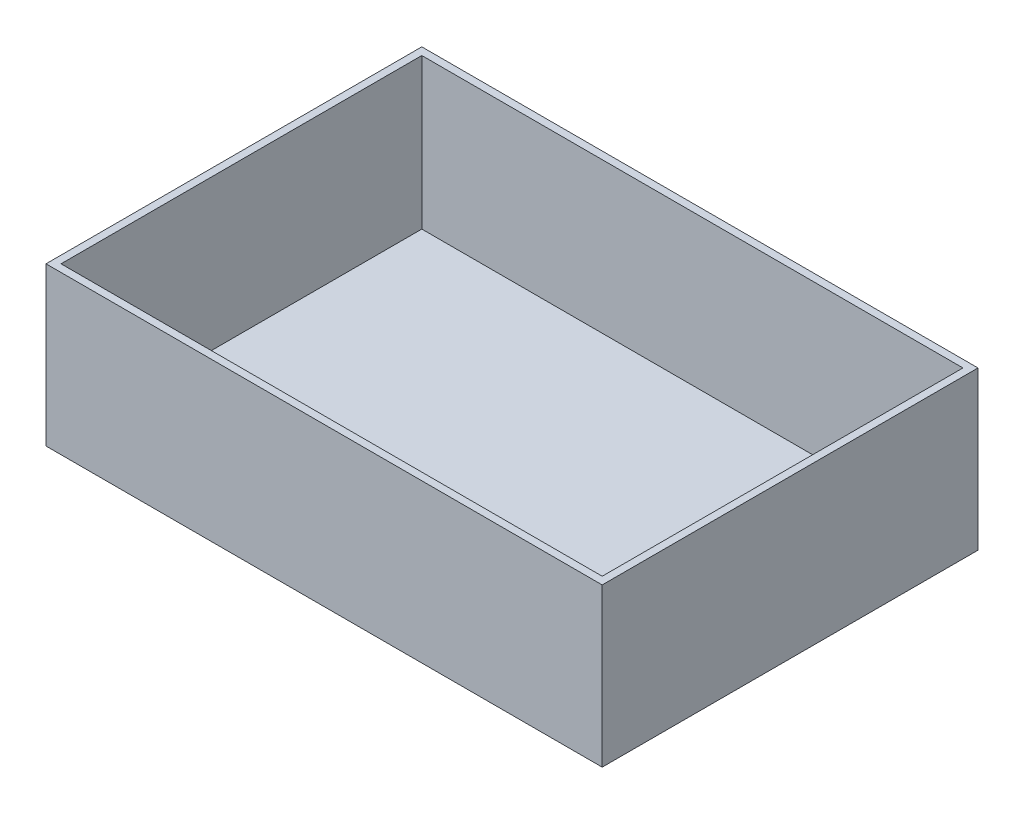
ISO-10303-21;
HEADER;
FILE_DESCRIPTION(('STEP AP214'),'2;1');
FILE_NAME('part.step','',(''),(''),'','','');
FILE_SCHEMA(('AUTOMOTIVE_DESIGN { 1 0 10303 214 1 1 1 1 }'));
ENDSEC;
DATA;
#1=APPLICATION_CONTEXT('core data for automotive mechanical design processes');
#2=APPLICATION_PROTOCOL_DEFINITION('international standard','automotive_design',2000,#1);
#3=PRODUCT_CONTEXT('',#1,'mechanical');
#4=PRODUCT('Part','Part','',(#3));
#5=PRODUCT_RELATED_PRODUCT_CATEGORY('part','',(#4));
#6=PRODUCT_DEFINITION_FORMATION('','',#4);
#7=PRODUCT_DEFINITION_CONTEXT('part definition',#1,'design');
#8=PRODUCT_DEFINITION('design','',#6,#7);
#9=PRODUCT_DEFINITION_SHAPE('','',#8);
#10=(LENGTH_UNIT() NAMED_UNIT(*) SI_UNIT(.MILLI.,.METRE.));
#11=(NAMED_UNIT(*) PLANE_ANGLE_UNIT() SI_UNIT($,.RADIAN.));
#12=(NAMED_UNIT(*) SI_UNIT($,.STERADIAN.) SOLID_ANGLE_UNIT());
#13=UNCERTAINTY_MEASURE_WITH_UNIT(LENGTH_MEASURE(1.E-05),#10,'distance_accuracy_value','');
#14=(GEOMETRIC_REPRESENTATION_CONTEXT(3) GLOBAL_UNCERTAINTY_ASSIGNED_CONTEXT((#13)) GLOBAL_UNIT_ASSIGNED_CONTEXT((#10,
#11,#12)) REPRESENTATION_CONTEXT('',''));
#15=CARTESIAN_POINT('',(0.,0.,0.));
#16=DIRECTION('',(0.,0.,1.));
#17=DIRECTION('',(1.,0.,0.));
#18=AXIS2_PLACEMENT_3D('',#15,#16,#17);
#19=CARTESIAN_POINT('',(0.,100.,0.));
#20=DIRECTION('',(0.,1.,0.));
#21=DIRECTION('',(0.,0.,1.));
#22=AXIS2_PLACEMENT_3D('',#19,#20,#21);
#23=PLANE('',#22);
#24=DIRECTION('',(0.,0.,-1.));
#25=VECTOR('',#24,1.);
#26=CARTESIAN_POINT('',(185.,100.,-125.));
#27=LINE('',#26,#25);
#28=CARTESIAN_POINT('',(185.,100.,125.));
#29=VERTEX_POINT('',#28);
#30=CARTESIAN_POINT('',(185.,100.,-125.));
#31=VERTEX_POINT('',#30);
#32=EDGE_CURVE('E152',#29,#31,#27,.T.);
#33=ORIENTED_EDGE('',*,*,#32,.T.);
#34=DIRECTION('',(-1.,0.,0.));
#35=VECTOR('',#34,1.);
#36=CARTESIAN_POINT('',(-185.,100.,-125.));
#37=LINE('',#36,#35);
#38=CARTESIAN_POINT('',(-185.,100.,-125.));
#39=VERTEX_POINT('',#38);
#40=EDGE_CURVE('E105',#31,#39,#37,.T.);
#41=ORIENTED_EDGE('',*,*,#40,.T.);
#42=DIRECTION('',(0.,0.,1.));
#43=VECTOR('',#42,1.);
#44=CARTESIAN_POINT('',(-185.,100.,-125.));
#45=LINE('',#44,#43);
#46=CARTESIAN_POINT('',(-185.,100.,125.));
#47=VERTEX_POINT('',#46);
#48=EDGE_CURVE('E155',#39,#47,#45,.T.);
#49=ORIENTED_EDGE('',*,*,#48,.T.);
#50=DIRECTION('',(1.,0.,0.));
#51=VECTOR('',#50,1.);
#52=CARTESIAN_POINT('',(-185.,100.,125.));
#53=LINE('',#52,#51);
#54=EDGE_CURVE('E58',#47,#29,#53,.T.);
#55=ORIENTED_EDGE('',*,*,#54,.T.);
#56=EDGE_LOOP('',(#33,#41,#49,#55));
#57=FACE_BOUND('',#56,.T.);
#58=DIRECTION('',(-1.,0.,0.));
#59=VECTOR('',#58,1.);
#60=CARTESIAN_POINT('',(-180.,100.,-120.));
#61=LINE('',#60,#59);
#62=CARTESIAN_POINT('',(180.,100.,-120.));
#63=VERTEX_POINT('',#62);
#64=CARTESIAN_POINT('',(-180.,100.,-120.));
#65=VERTEX_POINT('',#64);
#66=EDGE_CURVE('E127',#63,#65,#61,.T.);
#67=ORIENTED_EDGE('',*,*,#66,.F.);
#68=DIRECTION('',(0.,0.,-1.));
#69=VECTOR('',#68,1.);
#70=CARTESIAN_POINT('',(180.,100.,-120.));
#71=LINE('',#70,#69);
#72=CARTESIAN_POINT('',(180.,100.,120.));
#73=VERTEX_POINT('',#72);
#74=EDGE_CURVE('E125',#73,#63,#71,.T.);
#75=ORIENTED_EDGE('',*,*,#74,.F.);
#76=DIRECTION('',(1.,0.,0.));
#77=VECTOR('',#76,1.);
#78=CARTESIAN_POINT('',(-180.,100.,120.));
#79=LINE('',#78,#77);
#80=CARTESIAN_POINT('',(-180.,100.,120.));
#81=VERTEX_POINT('',#80);
#82=EDGE_CURVE('E132',#81,#73,#79,.T.);
#83=ORIENTED_EDGE('',*,*,#82,.F.);
#84=DIRECTION('',(0.,0.,1.));
#85=VECTOR('',#84,1.);
#86=CARTESIAN_POINT('',(-180.,100.,-120.));
#87=LINE('',#86,#85);
#88=EDGE_CURVE('E130',#65,#81,#87,.T.);
#89=ORIENTED_EDGE('',*,*,#88,.F.);
#90=EDGE_LOOP('',(#67,#75,#83,#89));
#91=FACE_BOUND('',#90,.T.);
#92=ADVANCED_FACE('F35',(#57,#91),#23,.T.);
#93=CARTESIAN_POINT('',(185.,100.,-125.));
#94=DIRECTION('',(-1.,0.,0.));
#95=DIRECTION('',(0.,0.,1.));
#96=AXIS2_PLACEMENT_3D('',#93,#94,#95);
#97=PLANE('',#96);
#98=DIRECTION('',(0.,-1.,0.));
#99=VECTOR('',#98,1.);
#100=CARTESIAN_POINT('',(185.,100.,125.));
#101=LINE('',#100,#99);
#102=CARTESIAN_POINT('',(185.,-5.,125.));
#103=VERTEX_POINT('',#102);
#104=EDGE_CURVE('E110',#29,#103,#101,.T.);
#105=ORIENTED_EDGE('',*,*,#104,.T.);
#106=DIRECTION('',(0.,0.,1.));
#107=VECTOR('',#106,1.);
#108=CARTESIAN_POINT('',(185.,-5.,-125.));
#109=LINE('',#108,#107);
#110=CARTESIAN_POINT('',(185.,-5.,-125.));
#111=VERTEX_POINT('',#110);
#112=EDGE_CURVE('E109',#111,#103,#109,.T.);
#113=ORIENTED_EDGE('',*,*,#112,.F.);
#114=DIRECTION('',(0.,-1.,0.));
#115=VECTOR('',#114,1.);
#116=CARTESIAN_POINT('',(185.,100.,-125.));
#117=LINE('',#116,#115);
#118=EDGE_CURVE('E11',#31,#111,#117,.T.);
#119=ORIENTED_EDGE('',*,*,#118,.F.);
#120=ORIENTED_EDGE('',*,*,#32,.F.);
#121=EDGE_LOOP('',(#105,#113,#119,#120));
#122=FACE_BOUND('',#121,.T.);
#123=ADVANCED_FACE('F37',(#122),#97,.F.);
#124=CARTESIAN_POINT('',(-185.,100.,-125.));
#125=DIRECTION('',(0.,0.,1.));
#126=DIRECTION('',(1.,0.,0.));
#127=AXIS2_PLACEMENT_3D('',#124,#125,#126);
#128=PLANE('',#127);
#129=ORIENTED_EDGE('',*,*,#118,.T.);
#130=DIRECTION('',(1.,0.,0.));
#131=VECTOR('',#130,1.);
#132=CARTESIAN_POINT('',(-185.,-5.,-125.));
#133=LINE('',#132,#131);
#134=CARTESIAN_POINT('',(-185.,-5.,-125.));
#135=VERTEX_POINT('',#134);
#136=EDGE_CURVE('E104',#135,#111,#133,.T.);
#137=ORIENTED_EDGE('',*,*,#136,.F.);
#138=DIRECTION('',(0.,-1.,0.));
#139=VECTOR('',#138,1.);
#140=CARTESIAN_POINT('',(-185.,100.,-125.));
#141=LINE('',#140,#139);
#142=EDGE_CURVE('E43',#39,#135,#141,.T.);
#143=ORIENTED_EDGE('',*,*,#142,.F.);
#144=ORIENTED_EDGE('',*,*,#40,.F.);
#145=EDGE_LOOP('',(#129,#137,#143,#144));
#146=FACE_BOUND('',#145,.T.);
#147=ADVANCED_FACE('F101',(#146),#128,.F.);
#148=CARTESIAN_POINT('',(-185.,100.,-125.));
#149=DIRECTION('',(1.,0.,0.));
#150=DIRECTION('',(0.,0.,-1.));
#151=AXIS2_PLACEMENT_3D('',#148,#149,#150);
#152=PLANE('',#151);
#153=ORIENTED_EDGE('',*,*,#142,.T.);
#154=DIRECTION('',(0.,0.,-1.));
#155=VECTOR('',#154,1.);
#156=CARTESIAN_POINT('',(-185.,-5.,125.));
#157=LINE('',#156,#155);
#158=CARTESIAN_POINT('',(-185.,-5.,125.));
#159=VERTEX_POINT('',#158);
#160=EDGE_CURVE('E119',#159,#135,#157,.T.);
#161=ORIENTED_EDGE('',*,*,#160,.F.);
#162=DIRECTION('',(0.,-1.,0.));
#163=VECTOR('',#162,1.);
#164=CARTESIAN_POINT('',(-185.,100.,125.));
#165=LINE('',#164,#163);
#166=EDGE_CURVE('E159',#47,#159,#165,.T.);
#167=ORIENTED_EDGE('',*,*,#166,.F.);
#168=ORIENTED_EDGE('',*,*,#48,.F.);
#169=EDGE_LOOP('',(#153,#161,#167,#168));
#170=FACE_BOUND('',#169,.T.);
#171=ADVANCED_FACE('F162',(#170),#152,.F.);
#172=CARTESIAN_POINT('',(-185.,100.,125.));
#173=DIRECTION('',(0.,0.,-1.));
#174=DIRECTION('',(-1.,0.,0.));
#175=AXIS2_PLACEMENT_3D('',#172,#173,#174);
#176=PLANE('',#175);
#177=ORIENTED_EDGE('',*,*,#166,.T.);
#178=DIRECTION('',(-1.,0.,0.));
#179=VECTOR('',#178,1.);
#180=CARTESIAN_POINT('',(185.,-5.,125.));
#181=LINE('',#180,#179);
#182=EDGE_CURVE('E114',#103,#159,#181,.T.);
#183=ORIENTED_EDGE('',*,*,#182,.F.);
#184=ORIENTED_EDGE('',*,*,#104,.F.);
#185=ORIENTED_EDGE('',*,*,#54,.F.);
#186=EDGE_LOOP('',(#177,#183,#184,#185));
#187=FACE_BOUND('',#186,.T.);
#188=ADVANCED_FACE('F198',(#187),#176,.F.);
#189=CARTESIAN_POINT('',(180.,100.,-120.));
#190=DIRECTION('',(-1.,0.,0.));
#191=DIRECTION('',(0.,0.,1.));
#192=AXIS2_PLACEMENT_3D('',#189,#190,#191);
#193=PLANE('',#192);
#194=DIRECTION('',(0.,0.,-1.));
#195=VECTOR('',#194,1.);
#196=CARTESIAN_POINT('',(180.,0.,-120.));
#197=LINE('',#196,#195);
#198=CARTESIAN_POINT('',(180.,0.,120.));
#199=VERTEX_POINT('',#198);
#200=CARTESIAN_POINT('',(180.,0.,-120.));
#201=VERTEX_POINT('',#200);
#202=EDGE_CURVE('E124',#199,#201,#197,.T.);
#203=ORIENTED_EDGE('',*,*,#202,.F.);
#204=DIRECTION('',(0.,-1.,0.));
#205=VECTOR('',#204,1.);
#206=CARTESIAN_POINT('',(180.,100.,120.));
#207=LINE('',#206,#205);
#208=EDGE_CURVE('E134',#73,#199,#207,.T.);
#209=ORIENTED_EDGE('',*,*,#208,.F.);
#210=ORIENTED_EDGE('',*,*,#74,.T.);
#211=DIRECTION('',(0.,-1.,0.));
#212=VECTOR('',#211,1.);
#213=CARTESIAN_POINT('',(180.,100.,-120.));
#214=LINE('',#213,#212);
#215=EDGE_CURVE('E149',#63,#201,#214,.T.);
#216=ORIENTED_EDGE('',*,*,#215,.T.);
#217=EDGE_LOOP('',(#203,#209,#210,#216));
#218=FACE_BOUND('',#217,.T.);
#219=ADVANCED_FACE('F182',(#218),#193,.T.);
#220=CARTESIAN_POINT('',(-180.,100.,-120.));
#221=DIRECTION('',(0.,0.,1.));
#222=DIRECTION('',(1.,0.,0.));
#223=AXIS2_PLACEMENT_3D('',#220,#221,#222);
#224=PLANE('',#223);
#225=DIRECTION('',(-1.,0.,0.));
#226=VECTOR('',#225,1.);
#227=CARTESIAN_POINT('',(-180.,0.,-120.));
#228=LINE('',#227,#226);
#229=CARTESIAN_POINT('',(-180.,0.,-120.));
#230=VERTEX_POINT('',#229);
#231=EDGE_CURVE('E137',#201,#230,#228,.T.);
#232=ORIENTED_EDGE('',*,*,#231,.F.);
#233=ORIENTED_EDGE('',*,*,#215,.F.);
#234=ORIENTED_EDGE('',*,*,#66,.T.);
#235=DIRECTION('',(0.,-1.,0.));
#236=VECTOR('',#235,1.);
#237=CARTESIAN_POINT('',(-180.,100.,-120.));
#238=LINE('',#237,#236);
#239=EDGE_CURVE('E147',#65,#230,#238,.T.);
#240=ORIENTED_EDGE('',*,*,#239,.T.);
#241=EDGE_LOOP('',(#232,#233,#234,#240));
#242=FACE_BOUND('',#241,.T.);
#243=ADVANCED_FACE('F174',(#242),#224,.T.);
#244=CARTESIAN_POINT('',(-180.,100.,-120.));
#245=DIRECTION('',(1.,0.,0.));
#246=DIRECTION('',(0.,0.,-1.));
#247=AXIS2_PLACEMENT_3D('',#244,#245,#246);
#248=PLANE('',#247);
#249=DIRECTION('',(0.,0.,1.));
#250=VECTOR('',#249,1.);
#251=CARTESIAN_POINT('',(-180.,0.,-120.));
#252=LINE('',#251,#250);
#253=CARTESIAN_POINT('',(-180.,0.,120.));
#254=VERTEX_POINT('',#253);
#255=EDGE_CURVE('E140',#230,#254,#252,.T.);
#256=ORIENTED_EDGE('',*,*,#255,.F.);
#257=ORIENTED_EDGE('',*,*,#239,.F.);
#258=ORIENTED_EDGE('',*,*,#88,.T.);
#259=DIRECTION('',(0.,-1.,0.));
#260=VECTOR('',#259,1.);
#261=CARTESIAN_POINT('',(-180.,100.,120.));
#262=LINE('',#261,#260);
#263=EDGE_CURVE('E50',#81,#254,#262,.T.);
#264=ORIENTED_EDGE('',*,*,#263,.T.);
#265=EDGE_LOOP('',(#256,#257,#258,#264));
#266=FACE_BOUND('',#265,.T.);
#267=ADVANCED_FACE('F177',(#266),#248,.T.);
#268=CARTESIAN_POINT('',(-180.,100.,120.));
#269=DIRECTION('',(0.,0.,-1.));
#270=DIRECTION('',(-1.,0.,0.));
#271=AXIS2_PLACEMENT_3D('',#268,#269,#270);
#272=PLANE('',#271);
#273=DIRECTION('',(1.,0.,0.));
#274=VECTOR('',#273,1.);
#275=CARTESIAN_POINT('',(-180.,0.,120.));
#276=LINE('',#275,#274);
#277=EDGE_CURVE('E128',#254,#199,#276,.T.);
#278=ORIENTED_EDGE('',*,*,#277,.F.);
#279=ORIENTED_EDGE('',*,*,#263,.F.);
#280=ORIENTED_EDGE('',*,*,#82,.T.);
#281=ORIENTED_EDGE('',*,*,#208,.T.);
#282=EDGE_LOOP('',(#278,#279,#280,#281));
#283=FACE_BOUND('',#282,.T.);
#284=ADVANCED_FACE('F184',(#283),#272,.T.);
#285=CARTESIAN_POINT('',(0.,0.,0.));
#286=DIRECTION('',(0.,-1.,0.));
#287=DIRECTION('',(0.,0.,-1.));
#288=AXIS2_PLACEMENT_3D('',#285,#286,#287);
#289=PLANE('',#288);
#290=ORIENTED_EDGE('',*,*,#202,.T.);
#291=ORIENTED_EDGE('',*,*,#231,.T.);
#292=ORIENTED_EDGE('',*,*,#255,.T.);
#293=ORIENTED_EDGE('',*,*,#277,.T.);
#294=EDGE_LOOP('',(#290,#291,#292,#293));
#295=FACE_BOUND('',#294,.T.);
#296=ADVANCED_FACE('F179',(#295),#289,.F.);
#297=CARTESIAN_POINT('',(0.,-5.,0.));
#298=DIRECTION('',(0.,-1.,0.));
#299=DIRECTION('',(0.,0.,-1.));
#300=AXIS2_PLACEMENT_3D('',#297,#298,#299);
#301=PLANE('',#300);
#302=ORIENTED_EDGE('',*,*,#136,.T.);
#303=ORIENTED_EDGE('',*,*,#112,.T.);
#304=ORIENTED_EDGE('',*,*,#182,.T.);
#305=ORIENTED_EDGE('',*,*,#160,.T.);
#306=EDGE_LOOP('',(#302,#303,#304,#305));
#307=FACE_BOUND('',#306,.T.);
#308=ADVANCED_FACE('F117',(#307),#301,.T.);
#309=CLOSED_SHELL('',(#92,#123,#147,#171,#188,#219,#243,#267,#284,#296,#308));
#310=MANIFOLD_SOLID_BREP('B2',#309);
#311=ADVANCED_BREP_SHAPE_REPRESENTATION('',(#18,#310),#14);
#312=SHAPE_DEFINITION_REPRESENTATION(#9,#311);
ENDSEC;
END-ISO-10303-21;
